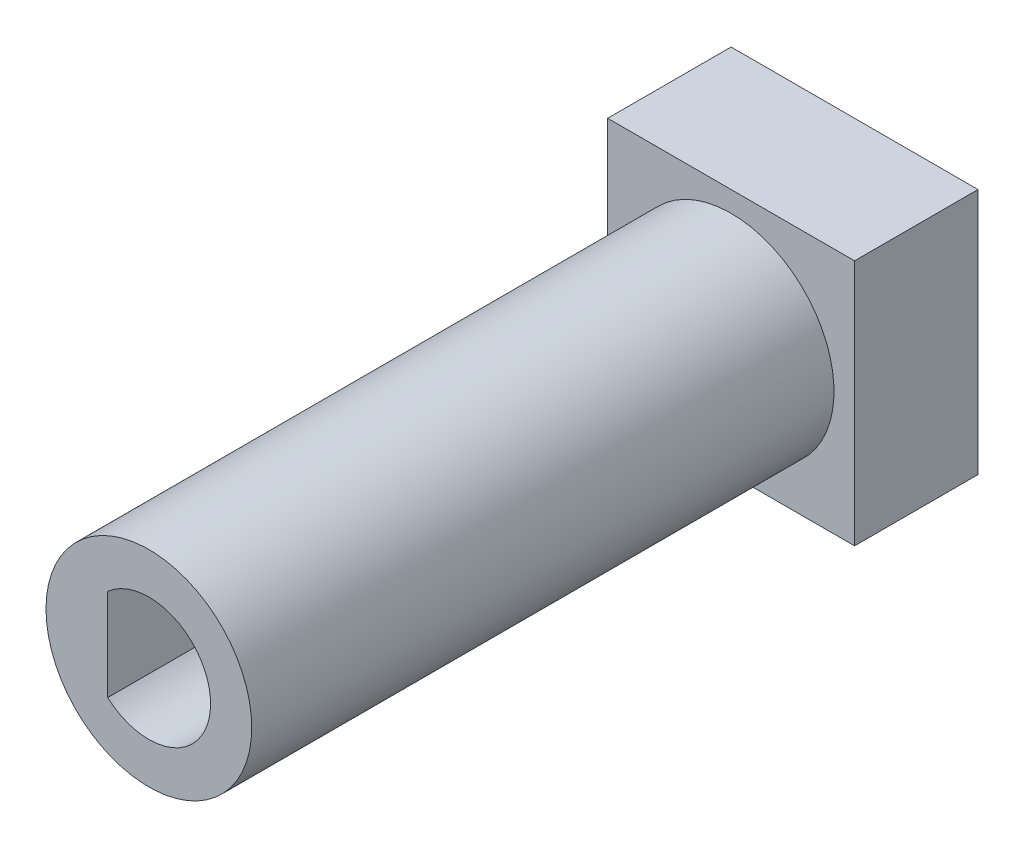
ISO-10303-21;
HEADER;
FILE_DESCRIPTION(('STEP AP214'),'2;1');
FILE_NAME('part.step','',(''),(''),'','','');
FILE_SCHEMA(('AUTOMOTIVE_DESIGN { 1 0 10303 214 1 1 1 1 }'));
ENDSEC;
DATA;
#1=APPLICATION_CONTEXT('core data for automotive mechanical design processes');
#2=APPLICATION_PROTOCOL_DEFINITION('international standard','automotive_design',2000,#1);
#3=PRODUCT_CONTEXT('',#1,'mechanical');
#4=PRODUCT('Part','Part','',(#3));
#5=PRODUCT_RELATED_PRODUCT_CATEGORY('part','',(#4));
#6=PRODUCT_DEFINITION_FORMATION('','',#4);
#7=PRODUCT_DEFINITION_CONTEXT('part definition',#1,'design');
#8=PRODUCT_DEFINITION('design','',#6,#7);
#9=PRODUCT_DEFINITION_SHAPE('','',#8);
#10=(LENGTH_UNIT() NAMED_UNIT(*) SI_UNIT(.MILLI.,.METRE.));
#11=(NAMED_UNIT(*) PLANE_ANGLE_UNIT() SI_UNIT($,.RADIAN.));
#12=(NAMED_UNIT(*) SI_UNIT($,.STERADIAN.) SOLID_ANGLE_UNIT());
#13=UNCERTAINTY_MEASURE_WITH_UNIT(LENGTH_MEASURE(1.E-05),#10,'distance_accuracy_value','');
#14=(GEOMETRIC_REPRESENTATION_CONTEXT(3) GLOBAL_UNCERTAINTY_ASSIGNED_CONTEXT((#13)) GLOBAL_UNIT_ASSIGNED_CONTEXT((#10,
#11,#12)) REPRESENTATION_CONTEXT('',''));
#15=CARTESIAN_POINT('',(0.,0.,0.));
#16=DIRECTION('',(0.,0.,1.));
#17=DIRECTION('',(1.,0.,0.));
#18=AXIS2_PLACEMENT_3D('',#15,#16,#17);
#19=CARTESIAN_POINT('',(6.,-6.,6.));
#20=DIRECTION('',(-1.,0.,0.));
#21=DIRECTION('',(0.,0.,1.));
#22=AXIS2_PLACEMENT_3D('',#19,#20,#21);
#23=PLANE('',#22);
#24=DIRECTION('',(0.,1.,0.));
#25=VECTOR('',#24,1.);
#26=CARTESIAN_POINT('',(6.,-6.,0.));
#27=LINE('',#26,#25);
#28=CARTESIAN_POINT('',(6.,-6.,0.));
#29=VERTEX_POINT('',#28);
#30=CARTESIAN_POINT('',(6.,6.,0.));
#31=VERTEX_POINT('',#30);
#32=EDGE_CURVE('E122',#29,#31,#27,.T.);
#33=ORIENTED_EDGE('',*,*,#32,.T.);
#34=DIRECTION('',(0.,0.,-1.));
#35=VECTOR('',#34,1.);
#36=CARTESIAN_POINT('',(6.,6.,6.));
#37=LINE('',#36,#35);
#38=CARTESIAN_POINT('',(6.,6.,6.));
#39=VERTEX_POINT('',#38);
#40=EDGE_CURVE('E42',#39,#31,#37,.T.);
#41=ORIENTED_EDGE('',*,*,#40,.F.);
#42=DIRECTION('',(0.,1.,0.));
#43=VECTOR('',#42,1.);
#44=CARTESIAN_POINT('',(6.,-6.,6.));
#45=LINE('',#44,#43);
#46=CARTESIAN_POINT('',(6.,-6.,6.));
#47=VERTEX_POINT('',#46);
#48=EDGE_CURVE('E123',#47,#39,#45,.T.);
#49=ORIENTED_EDGE('',*,*,#48,.F.);
#50=DIRECTION('',(0.,0.,-1.));
#51=VECTOR('',#50,1.);
#52=CARTESIAN_POINT('',(6.,-6.,6.));
#53=LINE('',#52,#51);
#54=EDGE_CURVE('E129',#47,#29,#53,.T.);
#55=ORIENTED_EDGE('',*,*,#54,.T.);
#56=EDGE_LOOP('',(#33,#41,#49,#55));
#57=FACE_BOUND('',#56,.T.);
#58=ADVANCED_FACE('F35',(#57),#23,.F.);
#59=CARTESIAN_POINT('',(-6.,6.,6.));
#60=DIRECTION('',(0.,-1.,0.));
#61=DIRECTION('',(0.,0.,-1.));
#62=AXIS2_PLACEMENT_3D('',#59,#60,#61);
#63=PLANE('',#62);
#64=DIRECTION('',(-1.,0.,0.));
#65=VECTOR('',#64,1.);
#66=CARTESIAN_POINT('',(-6.,6.,0.));
#67=LINE('',#66,#65);
#68=CARTESIAN_POINT('',(-6.,6.,0.));
#69=VERTEX_POINT('',#68);
#70=EDGE_CURVE('E132',#31,#69,#67,.T.);
#71=ORIENTED_EDGE('',*,*,#70,.T.);
#72=DIRECTION('',(0.,0.,-1.));
#73=VECTOR('',#72,1.);
#74=CARTESIAN_POINT('',(-6.,6.,6.));
#75=LINE('',#74,#73);
#76=CARTESIAN_POINT('',(-6.,6.,6.));
#77=VERTEX_POINT('',#76);
#78=EDGE_CURVE('E140',#77,#69,#75,.T.);
#79=ORIENTED_EDGE('',*,*,#78,.F.);
#80=DIRECTION('',(-1.,0.,0.));
#81=VECTOR('',#80,1.);
#82=CARTESIAN_POINT('',(-6.,6.,6.));
#83=LINE('',#82,#81);
#84=EDGE_CURVE('E87',#39,#77,#83,.T.);
#85=ORIENTED_EDGE('',*,*,#84,.F.);
#86=ORIENTED_EDGE('',*,*,#40,.T.);
#87=EDGE_LOOP('',(#71,#79,#85,#86));
#88=FACE_BOUND('',#87,.T.);
#89=ADVANCED_FACE('F143',(#88),#63,.F.);
#90=CARTESIAN_POINT('',(-6.,-6.,6.));
#91=DIRECTION('',(1.,0.,0.));
#92=DIRECTION('',(0.,0.,-1.));
#93=AXIS2_PLACEMENT_3D('',#90,#91,#92);
#94=PLANE('',#93);
#95=DIRECTION('',(0.,-1.,0.));
#96=VECTOR('',#95,1.);
#97=CARTESIAN_POINT('',(-6.,-6.,0.));
#98=LINE('',#97,#96);
#99=CARTESIAN_POINT('',(-6.,-6.,0.));
#100=VERTEX_POINT('',#99);
#101=EDGE_CURVE('E134',#69,#100,#98,.T.);
#102=ORIENTED_EDGE('',*,*,#101,.T.);
#103=DIRECTION('',(0.,0.,-1.));
#104=VECTOR('',#103,1.);
#105=CARTESIAN_POINT('',(-6.,-6.,6.));
#106=LINE('',#105,#104);
#107=CARTESIAN_POINT('',(-6.,-6.,6.));
#108=VERTEX_POINT('',#107);
#109=EDGE_CURVE('E138',#108,#100,#106,.T.);
#110=ORIENTED_EDGE('',*,*,#109,.F.);
#111=DIRECTION('',(0.,-1.,0.));
#112=VECTOR('',#111,1.);
#113=CARTESIAN_POINT('',(-6.,-6.,6.));
#114=LINE('',#113,#112);
#115=EDGE_CURVE('E126',#77,#108,#114,.T.);
#116=ORIENTED_EDGE('',*,*,#115,.F.);
#117=ORIENTED_EDGE('',*,*,#78,.T.);
#118=EDGE_LOOP('',(#102,#110,#116,#117));
#119=FACE_BOUND('',#118,.T.);
#120=ADVANCED_FACE('F152',(#119),#94,.F.);
#121=CARTESIAN_POINT('',(-6.,-6.,6.));
#122=DIRECTION('',(0.,1.,0.));
#123=DIRECTION('',(0.,0.,1.));
#124=AXIS2_PLACEMENT_3D('',#121,#122,#123);
#125=PLANE('',#124);
#126=DIRECTION('',(1.,0.,0.));
#127=VECTOR('',#126,1.);
#128=CARTESIAN_POINT('',(-6.,-6.,0.));
#129=LINE('',#128,#127);
#130=EDGE_CURVE('E79',#100,#29,#129,.T.);
#131=ORIENTED_EDGE('',*,*,#130,.T.);
#132=ORIENTED_EDGE('',*,*,#54,.F.);
#133=DIRECTION('',(1.,0.,0.));
#134=VECTOR('',#133,1.);
#135=CARTESIAN_POINT('',(-6.,-6.,6.));
#136=LINE('',#135,#134);
#137=EDGE_CURVE('E58',#108,#47,#136,.T.);
#138=ORIENTED_EDGE('',*,*,#137,.F.);
#139=ORIENTED_EDGE('',*,*,#109,.T.);
#140=EDGE_LOOP('',(#131,#132,#138,#139));
#141=FACE_BOUND('',#140,.T.);
#142=ADVANCED_FACE('F154',(#141),#125,.F.);
#143=CARTESIAN_POINT('',(0.,0.,6.));
#144=DIRECTION('',(0.,0.,-1.));
#145=DIRECTION('',(-1.,0.,0.));
#146=AXIS2_PLACEMENT_3D('',#143,#144,#145);
#147=PLANE('',#146);
#148=CARTESIAN_POINT('',(0.,0.,6.));
#149=DIRECTION('',(0.,0.,-1.));
#150=DIRECTION('',(-1.,0.,0.));
#151=AXIS2_PLACEMENT_3D('',#148,#149,#150);
#152=CIRCLE('',#151,5.);
#153=CARTESIAN_POINT('',(-5.,0.,6.));
#154=VERTEX_POINT('',#153);
#155=EDGE_CURVE('E11',#154,#154,#152,.F.);
#156=ORIENTED_EDGE('',*,*,#155,.F.);
#157=EDGE_LOOP('',(#156));
#158=FACE_BOUND('',#157,.T.);
#159=ORIENTED_EDGE('',*,*,#48,.T.);
#160=ORIENTED_EDGE('',*,*,#84,.T.);
#161=ORIENTED_EDGE('',*,*,#115,.T.);
#162=ORIENTED_EDGE('',*,*,#137,.T.);
#163=EDGE_LOOP('',(#159,#160,#161,#162));
#164=FACE_BOUND('',#163,.T.);
#165=ADVANCED_FACE('F155',(#158,#164),#147,.F.);
#166=CARTESIAN_POINT('',(0.,0.,0.));
#167=DIRECTION('',(0.,0.,-1.));
#168=DIRECTION('',(-1.,0.,0.));
#169=AXIS2_PLACEMENT_3D('',#166,#167,#168);
#170=PLANE('',#169);
#171=CARTESIAN_POINT('',(0.,0.,0.));
#172=DIRECTION('',(0.,0.,-1.));
#173=DIRECTION('',(-1.,0.,0.));
#174=AXIS2_PLACEMENT_3D('',#171,#172,#173);
#175=CIRCLE('',#174,4.);
#176=CARTESIAN_POINT('',(-4.,0.,0.));
#177=VERTEX_POINT('',#176);
#178=EDGE_CURVE('E262',#177,#177,#175,.T.);
#179=ORIENTED_EDGE('',*,*,#178,.F.);
#180=EDGE_LOOP('',(#179));
#181=FACE_BOUND('',#180,.T.);
#182=ORIENTED_EDGE('',*,*,#32,.F.);
#183=ORIENTED_EDGE('',*,*,#130,.F.);
#184=ORIENTED_EDGE('',*,*,#101,.F.);
#185=ORIENTED_EDGE('',*,*,#70,.F.);
#186=EDGE_LOOP('',(#182,#183,#184,#185));
#187=FACE_BOUND('',#186,.T.);
#188=ADVANCED_FACE('F148',(#181,#187),#170,.T.);
#189=CARTESIAN_POINT('',(0.,0.,16.));
#190=DIRECTION('',(0.,0.,-1.));
#191=DIRECTION('',(-1.,0.,0.));
#192=AXIS2_PLACEMENT_3D('',#189,#190,#191);
#193=CYLINDRICAL_SURFACE('',#192,5.);
#194=ORIENTED_EDGE('',*,*,#155,.T.);
#195=EDGE_LOOP('',(#194));
#196=FACE_BOUND('',#195,.T.);
#197=CARTESIAN_POINT('',(0.,0.,34.3));
#198=DIRECTION('',(0.,0.,1.));
#199=DIRECTION('',(1.,0.,0.));
#200=AXIS2_PLACEMENT_3D('',#197,#198,#199);
#201=CIRCLE('',#200,5.);
#202=CARTESIAN_POINT('',(5.,0.,34.3));
#203=VERTEX_POINT('',#202);
#204=EDGE_CURVE('E118',#203,#203,#201,.T.);
#205=ORIENTED_EDGE('',*,*,#204,.F.);
#206=EDGE_LOOP('',(#205));
#207=FACE_BOUND('',#206,.T.);
#208=ADVANCED_FACE('F163',(#196,#207),#193,.T.);
#209=CARTESIAN_POINT('',(0.,0.,34.3));
#210=DIRECTION('',(0.,0.,1.));
#211=DIRECTION('',(1.,0.,0.));
#212=AXIS2_PLACEMENT_3D('',#209,#210,#211);
#213=PLANE('',#212);
#214=CARTESIAN_POINT('',(0.,0.,34.3));
#215=DIRECTION('',(0.,0.,1.));
#216=DIRECTION('',(1.,0.,0.));
#217=AXIS2_PLACEMENT_3D('',#214,#215,#216);
#218=CIRCLE('',#217,3.);
#219=CARTESIAN_POINT('',(-2.,-2.23606797749979,34.3));
#220=VERTEX_POINT('',#219);
#221=CARTESIAN_POINT('',(-2.,2.23606797749979,34.3));
#222=VERTEX_POINT('',#221);
#223=EDGE_CURVE('E49',#220,#222,#218,.T.);
#224=ORIENTED_EDGE('',*,*,#223,.F.);
#225=DIRECTION('',(0.,-1.,0.));
#226=VECTOR('',#225,1.);
#227=CARTESIAN_POINT('',(-2.,2.23606797749979,34.3));
#228=LINE('',#227,#226);
#229=EDGE_CURVE('E109',#222,#220,#228,.T.);
#230=ORIENTED_EDGE('',*,*,#229,.F.);
#231=EDGE_LOOP('',(#224,#230));
#232=FACE_BOUND('',#231,.T.);
#233=ORIENTED_EDGE('',*,*,#204,.T.);
#234=EDGE_LOOP('',(#233));
#235=FACE_BOUND('',#234,.T.);
#236=ADVANCED_FACE('F197',(#232,#235),#213,.T.);
#237=CARTESIAN_POINT('',(0.,0.,12.3));
#238=DIRECTION('',(0.,0.,1.));
#239=DIRECTION('',(1.,0.,0.));
#240=AXIS2_PLACEMENT_3D('',#237,#238,#239);
#241=CYLINDRICAL_SURFACE('',#240,3.);
#242=ORIENTED_EDGE('',*,*,#223,.T.);
#243=DIRECTION('',(0.,0.,1.));
#244=VECTOR('',#243,1.);
#245=CARTESIAN_POINT('',(-2.,2.23606797749979,12.3));
#246=LINE('',#245,#244);
#247=CARTESIAN_POINT('',(-2.,2.23606797749979,12.3));
#248=VERTEX_POINT('',#247);
#249=EDGE_CURVE('E95',#248,#222,#246,.T.);
#250=ORIENTED_EDGE('',*,*,#249,.F.);
#251=CARTESIAN_POINT('',(0.,0.,12.3));
#252=DIRECTION('',(0.,0.,1.));
#253=DIRECTION('',(1.,0.,0.));
#254=AXIS2_PLACEMENT_3D('',#251,#252,#253);
#255=CIRCLE('',#254,3.);
#256=CARTESIAN_POINT('',(-2.,-2.23606797749979,12.3));
#257=VERTEX_POINT('',#256);
#258=EDGE_CURVE('E98',#257,#248,#255,.T.);
#259=ORIENTED_EDGE('',*,*,#258,.F.);
#260=DIRECTION('',(0.,0.,1.));
#261=VECTOR('',#260,1.);
#262=CARTESIAN_POINT('',(-2.,-2.23606797749979,12.3));
#263=LINE('',#262,#261);
#264=EDGE_CURVE('E104',#257,#220,#263,.T.);
#265=ORIENTED_EDGE('',*,*,#264,.T.);
#266=EDGE_LOOP('',(#242,#250,#259,#265));
#267=FACE_BOUND('',#266,.T.);
#268=ADVANCED_FACE('F97',(#267),#241,.F.);
#269=CARTESIAN_POINT('',(-2.,2.23606797749979,12.3));
#270=DIRECTION('',(-1.,0.,0.));
#271=DIRECTION('',(0.,0.,1.));
#272=AXIS2_PLACEMENT_3D('',#269,#270,#271);
#273=PLANE('',#272);
#274=ORIENTED_EDGE('',*,*,#229,.T.);
#275=ORIENTED_EDGE('',*,*,#264,.F.);
#276=DIRECTION('',(0.,-1.,0.));
#277=VECTOR('',#276,1.);
#278=CARTESIAN_POINT('',(-2.,2.23606797749979,12.3));
#279=LINE('',#278,#277);
#280=EDGE_CURVE('E105',#248,#257,#279,.T.);
#281=ORIENTED_EDGE('',*,*,#280,.F.);
#282=ORIENTED_EDGE('',*,*,#249,.T.);
#283=EDGE_LOOP('',(#274,#275,#281,#282));
#284=FACE_BOUND('',#283,.T.);
#285=ADVANCED_FACE('F111',(#284),#273,.F.);
#286=CARTESIAN_POINT('',(0.,0.,12.3));
#287=DIRECTION('',(0.,0.,1.));
#288=DIRECTION('',(1.,0.,0.));
#289=AXIS2_PLACEMENT_3D('',#286,#287,#288);
#290=PLANE('',#289);
#291=ORIENTED_EDGE('',*,*,#258,.T.);
#292=ORIENTED_EDGE('',*,*,#280,.T.);
#293=EDGE_LOOP('',(#291,#292));
#294=FACE_BOUND('',#293,.T.);
#295=ADVANCED_FACE('F108',(#294),#290,.T.);
#296=CARTESIAN_POINT('',(0.,0.,6.));
#297=DIRECTION('',(0.,0.,-1.));
#298=DIRECTION('',(-1.,0.,0.));
#299=AXIS2_PLACEMENT_3D('',#296,#297,#298);
#300=CYLINDRICAL_SURFACE('',#299,4.);
#301=CARTESIAN_POINT('',(0.,0.,6.));
#302=DIRECTION('',(0.,0.,-1.));
#303=DIRECTION('',(-1.,0.,0.));
#304=AXIS2_PLACEMENT_3D('',#301,#302,#303);
#305=CIRCLE('',#304,4.);
#306=CARTESIAN_POINT('',(-4.,0.,6.));
#307=VERTEX_POINT('',#306);
#308=EDGE_CURVE('E116',#307,#307,#305,.T.);
#309=ORIENTED_EDGE('',*,*,#308,.F.);
#310=EDGE_LOOP('',(#309));
#311=FACE_BOUND('',#310,.T.);
#312=ORIENTED_EDGE('',*,*,#178,.T.);
#313=EDGE_LOOP('',(#312));
#314=FACE_BOUND('',#313,.T.);
#315=ADVANCED_FACE('F232',(#311,#314),#300,.F.);
#316=CARTESIAN_POINT('',(0.,0.,6.));
#317=DIRECTION('',(0.,0.,-1.));
#318=DIRECTION('',(-1.,0.,0.));
#319=AXIS2_PLACEMENT_3D('',#316,#317,#318);
#320=PLANE('',#319);
#321=ORIENTED_EDGE('',*,*,#308,.T.);
#322=EDGE_LOOP('',(#321));
#323=FACE_BOUND('',#322,.T.);
#324=ADVANCED_FACE('F246',(#323),#320,.T.);
#325=CLOSED_SHELL('',(#58,#89,#120,#142,#165,#188,#208,#236,#268,#285,#295,#315,#324));
#326=MANIFOLD_SOLID_BREP('B2',#325);
#327=ADVANCED_BREP_SHAPE_REPRESENTATION('',(#18,#326),#14);
#328=SHAPE_DEFINITION_REPRESENTATION(#9,#327);
ENDSEC;
END-ISO-10303-21;
